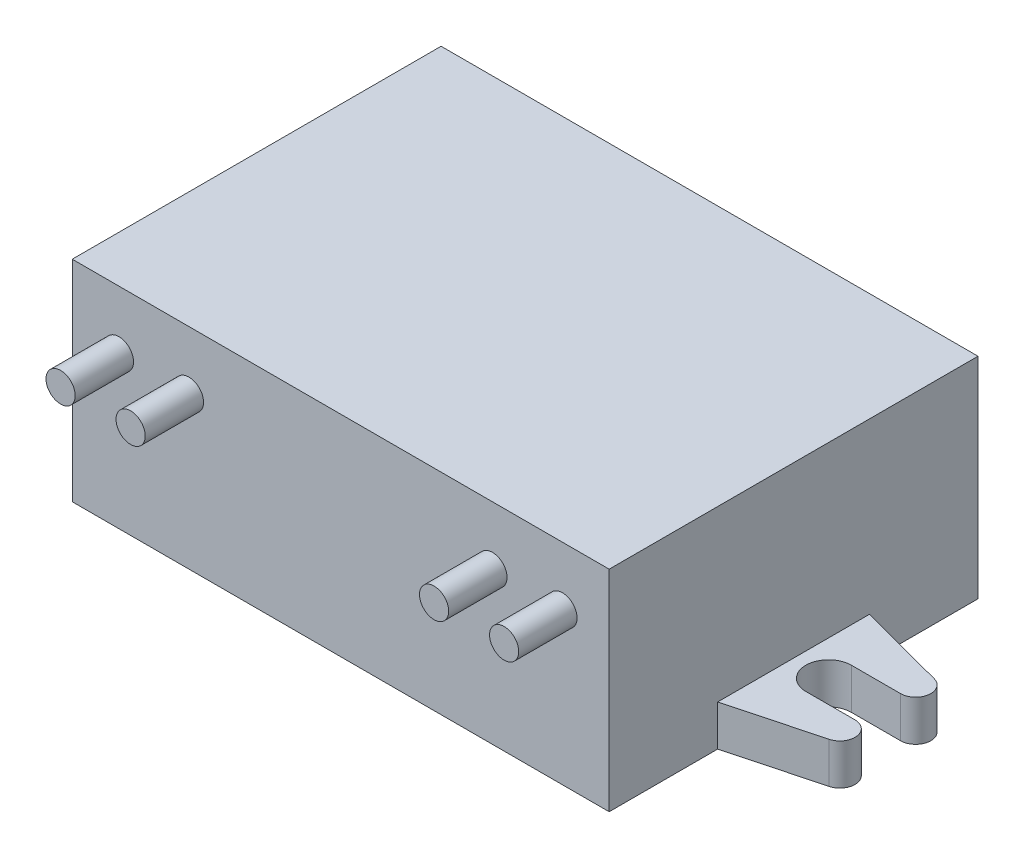
ISO-10303-21;
HEADER;
FILE_DESCRIPTION(('STEP AP214'),'2;1');
FILE_NAME('part.step','',(''),(''),'','','');
FILE_SCHEMA(('AUTOMOTIVE_DESIGN { 1 0 10303 214 1 1 1 1 }'));
ENDSEC;
DATA;
#1=APPLICATION_CONTEXT('core data for automotive mechanical design processes');
#2=APPLICATION_PROTOCOL_DEFINITION('international standard','automotive_design',2000,#1);
#3=PRODUCT_CONTEXT('',#1,'mechanical');
#4=PRODUCT('Part','Part','',(#3));
#5=PRODUCT_RELATED_PRODUCT_CATEGORY('part','',(#4));
#6=PRODUCT_DEFINITION_FORMATION('','',#4);
#7=PRODUCT_DEFINITION_CONTEXT('part definition',#1,'design');
#8=PRODUCT_DEFINITION('design','',#6,#7);
#9=PRODUCT_DEFINITION_SHAPE('','',#8);
#10=(LENGTH_UNIT() NAMED_UNIT(*) SI_UNIT(.MILLI.,.METRE.));
#11=(NAMED_UNIT(*) PLANE_ANGLE_UNIT() SI_UNIT($,.RADIAN.));
#12=(NAMED_UNIT(*) SI_UNIT($,.STERADIAN.) SOLID_ANGLE_UNIT());
#13=UNCERTAINTY_MEASURE_WITH_UNIT(LENGTH_MEASURE(1.E-05),#10,'distance_accuracy_value','');
#14=(GEOMETRIC_REPRESENTATION_CONTEXT(3) GLOBAL_UNCERTAINTY_ASSIGNED_CONTEXT((#13)) GLOBAL_UNIT_ASSIGNED_CONTEXT((#10,
#11,#12)) REPRESENTATION_CONTEXT('',''));
#15=CARTESIAN_POINT('',(0.,0.,0.));
#16=DIRECTION('',(0.,0.,1.));
#17=DIRECTION('',(1.,0.,0.));
#18=AXIS2_PLACEMENT_3D('',#15,#16,#17);
#19=CARTESIAN_POINT('',(-23.,18.,0.));
#20=DIRECTION('',(1.,0.,0.));
#21=DIRECTION('',(0.,0.,-1.));
#22=AXIS2_PLACEMENT_3D('',#19,#20,#21);
#23=PLANE('',#22);
#24=DIRECTION('',(0.,-1.,0.));
#25=VECTOR('',#24,1.);
#26=CARTESIAN_POINT('',(-23.,3.5,-6.49999999999999));
#27=LINE('',#26,#25);
#28=CARTESIAN_POINT('',(-23.,3.5,-6.49999999999999));
#29=VERTEX_POINT('',#28);
#30=CARTESIAN_POINT('',(-23.,0.,-6.49999999999999));
#31=VERTEX_POINT('',#30);
#32=EDGE_CURVE('E264',#29,#31,#27,.T.);
#33=ORIENTED_EDGE('',*,*,#32,.F.);
#34=DIRECTION('',(0.,0.,1.));
#35=VECTOR('',#34,1.);
#36=CARTESIAN_POINT('',(-23.,3.5,0.));
#37=LINE('',#36,#35);
#38=CARTESIAN_POINT('',(-23.,3.5,6.50000000000001));
#39=VERTEX_POINT('',#38);
#40=EDGE_CURVE('E261',#29,#39,#37,.T.);
#41=ORIENTED_EDGE('',*,*,#40,.T.);
#42=DIRECTION('',(0.,-1.,0.));
#43=VECTOR('',#42,1.);
#44=CARTESIAN_POINT('',(-23.,3.5,6.50000000000001));
#45=LINE('',#44,#43);
#46=CARTESIAN_POINT('',(-23.,0.,6.50000000000001));
#47=VERTEX_POINT('',#46);
#48=EDGE_CURVE('E279',#39,#47,#45,.T.);
#49=ORIENTED_EDGE('',*,*,#48,.T.);
#50=DIRECTION('',(0.,0.,1.));
#51=VECTOR('',#50,1.);
#52=CARTESIAN_POINT('',(-23.,0.,0.));
#53=LINE('',#52,#51);
#54=CARTESIAN_POINT('',(-23.,0.,15.8));
#55=VERTEX_POINT('',#54);
#56=EDGE_CURVE('E317',#47,#55,#53,.T.);
#57=ORIENTED_EDGE('',*,*,#56,.T.);
#58=DIRECTION('',(0.,-1.,0.));
#59=VECTOR('',#58,1.);
#60=CARTESIAN_POINT('',(-23.,18.,15.8));
#61=LINE('',#60,#59);
#62=CARTESIAN_POINT('',(-23.,18.,15.8));
#63=VERTEX_POINT('',#62);
#64=EDGE_CURVE('E325',#63,#55,#61,.T.);
#65=ORIENTED_EDGE('',*,*,#64,.F.);
#66=DIRECTION('',(0.,0.,1.));
#67=VECTOR('',#66,1.);
#68=CARTESIAN_POINT('',(-23.,18.,0.));
#69=LINE('',#68,#67);
#70=CARTESIAN_POINT('',(-23.,18.,-15.8));
#71=VERTEX_POINT('',#70);
#72=EDGE_CURVE('E306',#71,#63,#69,.T.);
#73=ORIENTED_EDGE('',*,*,#72,.F.);
#74=DIRECTION('',(0.,-1.,0.));
#75=VECTOR('',#74,1.);
#76=CARTESIAN_POINT('',(-23.,18.,-15.8));
#77=LINE('',#76,#75);
#78=CARTESIAN_POINT('',(-23.,0.,-15.8));
#79=VERTEX_POINT('',#78);
#80=EDGE_CURVE('E328',#71,#79,#77,.T.);
#81=ORIENTED_EDGE('',*,*,#80,.T.);
#82=EDGE_CURVE('E318',#79,#31,#53,.T.);
#83=ORIENTED_EDGE('',*,*,#82,.T.);
#84=EDGE_LOOP('',(#33,#41,#49,#57,#65,#73,#81,#83));
#85=FACE_BOUND('',#84,.T.);
#86=ADVANCED_FACE('F36',(#85),#23,.F.);
#87=CARTESIAN_POINT('',(23.,18.,0.));
#88=DIRECTION('',(1.,0.,0.));
#89=DIRECTION('',(0.,0.,-1.));
#90=AXIS2_PLACEMENT_3D('',#87,#88,#89);
#91=PLANE('',#90);
#92=DIRECTION('',(0.,-1.,0.));
#93=VECTOR('',#92,1.);
#94=CARTESIAN_POINT('',(23.,3.5,6.50000000000001));
#95=LINE('',#94,#93);
#96=CARTESIAN_POINT('',(23.,3.5,6.50000000000001));
#97=VERTEX_POINT('',#96);
#98=CARTESIAN_POINT('',(23.,0.,6.50000000000001));
#99=VERTEX_POINT('',#98);
#100=EDGE_CURVE('E235',#97,#99,#95,.T.);
#101=ORIENTED_EDGE('',*,*,#100,.F.);
#102=DIRECTION('',(0.,0.,1.));
#103=VECTOR('',#102,1.);
#104=CARTESIAN_POINT('',(23.,3.5,0.));
#105=LINE('',#104,#103);
#106=CARTESIAN_POINT('',(23.,3.5,-6.49999999999999));
#107=VERTEX_POINT('',#106);
#108=EDGE_CURVE('E214',#107,#97,#105,.T.);
#109=ORIENTED_EDGE('',*,*,#108,.F.);
#110=DIRECTION('',(0.,-1.,0.));
#111=VECTOR('',#110,1.);
#112=CARTESIAN_POINT('',(23.,3.5,-6.49999999999999));
#113=LINE('',#112,#111);
#114=CARTESIAN_POINT('',(23.,0.,-6.49999999999999));
#115=VERTEX_POINT('',#114);
#116=EDGE_CURVE('E237',#107,#115,#113,.T.);
#117=ORIENTED_EDGE('',*,*,#116,.T.);
#118=DIRECTION('',(0.,0.,1.));
#119=VECTOR('',#118,1.);
#120=CARTESIAN_POINT('',(23.,0.,0.));
#121=LINE('',#120,#119);
#122=CARTESIAN_POINT('',(23.,0.,-15.8));
#123=VERTEX_POINT('',#122);
#124=EDGE_CURVE('E311',#123,#115,#121,.T.);
#125=ORIENTED_EDGE('',*,*,#124,.F.);
#126=DIRECTION('',(0.,-1.,0.));
#127=VECTOR('',#126,1.);
#128=CARTESIAN_POINT('',(23.,18.,-15.8));
#129=LINE('',#128,#127);
#130=CARTESIAN_POINT('',(23.,18.,-15.8));
#131=VERTEX_POINT('',#130);
#132=EDGE_CURVE('E330',#131,#123,#129,.T.);
#133=ORIENTED_EDGE('',*,*,#132,.F.);
#134=DIRECTION('',(0.,0.,1.));
#135=VECTOR('',#134,1.);
#136=CARTESIAN_POINT('',(23.,18.,0.));
#137=LINE('',#136,#135);
#138=CARTESIAN_POINT('',(23.,18.,15.8));
#139=VERTEX_POINT('',#138);
#140=EDGE_CURVE('E299',#131,#139,#137,.T.);
#141=ORIENTED_EDGE('',*,*,#140,.T.);
#142=DIRECTION('',(0.,-1.,0.));
#143=VECTOR('',#142,1.);
#144=CARTESIAN_POINT('',(23.,18.,15.8));
#145=LINE('',#144,#143);
#146=CARTESIAN_POINT('',(23.,0.,15.8));
#147=VERTEX_POINT('',#146);
#148=EDGE_CURVE('E310',#139,#147,#145,.T.);
#149=ORIENTED_EDGE('',*,*,#148,.T.);
#150=EDGE_CURVE('E298',#99,#147,#121,.T.);
#151=ORIENTED_EDGE('',*,*,#150,.F.);
#152=EDGE_LOOP('',(#101,#109,#117,#125,#133,#141,#149,#151));
#153=FACE_BOUND('',#152,.T.);
#154=ADVANCED_FACE('F38',(#153),#91,.T.);
#155=CARTESIAN_POINT('',(0.,18.,-15.8));
#156=DIRECTION('',(0.,0.,-1.));
#157=DIRECTION('',(-1.,0.,0.));
#158=AXIS2_PLACEMENT_3D('',#155,#156,#157);
#159=PLANE('',#158);
#160=DIRECTION('',(1.,0.,0.));
#161=VECTOR('',#160,1.);
#162=CARTESIAN_POINT('',(0.,0.,-15.8));
#163=LINE('',#162,#161);
#164=EDGE_CURVE('E314',#79,#123,#163,.T.);
#165=ORIENTED_EDGE('',*,*,#164,.F.);
#166=ORIENTED_EDGE('',*,*,#80,.F.);
#167=DIRECTION('',(1.,0.,0.));
#168=VECTOR('',#167,1.);
#169=CARTESIAN_POINT('',(0.,18.,-15.8));
#170=LINE('',#169,#168);
#171=EDGE_CURVE('E302',#71,#131,#170,.T.);
#172=ORIENTED_EDGE('',*,*,#171,.T.);
#173=ORIENTED_EDGE('',*,*,#132,.T.);
#174=EDGE_LOOP('',(#165,#166,#172,#173));
#175=FACE_BOUND('',#174,.T.);
#176=ADVANCED_FACE('F346',(#175),#159,.T.);
#177=CARTESIAN_POINT('',(0.,18.,15.8));
#178=DIRECTION('',(0.,0.,-1.));
#179=DIRECTION('',(-1.,0.,0.));
#180=AXIS2_PLACEMENT_3D('',#177,#178,#179);
#181=PLANE('',#180);
#182=CARTESIAN_POINT('',(-13.,13.,15.8));
#183=DIRECTION('',(0.,0.,-1.));
#184=DIRECTION('',(-1.,0.,0.));
#185=AXIS2_PLACEMENT_3D('',#182,#183,#184);
#186=CIRCLE('',#185,1.25);
#187=CARTESIAN_POINT('',(-14.25,13.,15.8));
#188=VERTEX_POINT('',#187);
#189=EDGE_CURVE('E11',#188,#188,#186,.F.);
#190=ORIENTED_EDGE('',*,*,#189,.F.);
#191=EDGE_LOOP('',(#190));
#192=FACE_BOUND('',#191,.T.);
#193=CARTESIAN_POINT('',(-19.,13.,15.8));
#194=DIRECTION('',(0.,0.,-1.));
#195=DIRECTION('',(-1.,0.,0.));
#196=AXIS2_PLACEMENT_3D('',#193,#194,#195);
#197=CIRCLE('',#196,1.25);
#198=CARTESIAN_POINT('',(-20.25,13.,15.8));
#199=VERTEX_POINT('',#198);
#200=EDGE_CURVE('E44',#199,#199,#197,.F.);
#201=ORIENTED_EDGE('',*,*,#200,.F.);
#202=EDGE_LOOP('',(#201));
#203=FACE_BOUND('',#202,.T.);
#204=CARTESIAN_POINT('',(13.,13.,15.8));
#205=DIRECTION('',(0.,0.,-1.));
#206=DIRECTION('',(-1.,0.,0.));
#207=AXIS2_PLACEMENT_3D('',#204,#205,#206);
#208=CIRCLE('',#207,1.25);
#209=CARTESIAN_POINT('',(11.75,13.,15.8));
#210=VERTEX_POINT('',#209);
#211=EDGE_CURVE('E335',#210,#210,#208,.F.);
#212=ORIENTED_EDGE('',*,*,#211,.F.);
#213=EDGE_LOOP('',(#212));
#214=FACE_BOUND('',#213,.T.);
#215=CARTESIAN_POINT('',(19.,13.,15.8));
#216=DIRECTION('',(0.,0.,-1.));
#217=DIRECTION('',(-1.,0.,0.));
#218=AXIS2_PLACEMENT_3D('',#215,#216,#217);
#219=CIRCLE('',#218,1.25);
#220=CARTESIAN_POINT('',(17.75,13.,15.8));
#221=VERTEX_POINT('',#220);
#222=EDGE_CURVE('E332',#221,#221,#219,.F.);
#223=ORIENTED_EDGE('',*,*,#222,.F.);
#224=EDGE_LOOP('',(#223));
#225=FACE_BOUND('',#224,.T.);
#226=DIRECTION('',(1.,0.,0.));
#227=VECTOR('',#226,1.);
#228=CARTESIAN_POINT('',(0.,0.,15.8));
#229=LINE('',#228,#227);
#230=EDGE_CURVE('E303',#55,#147,#229,.T.);
#231=ORIENTED_EDGE('',*,*,#230,.T.);
#232=ORIENTED_EDGE('',*,*,#148,.F.);
#233=DIRECTION('',(1.,0.,0.));
#234=VECTOR('',#233,1.);
#235=CARTESIAN_POINT('',(0.,18.,15.8));
#236=LINE('',#235,#234);
#237=EDGE_CURVE('E308',#63,#139,#236,.T.);
#238=ORIENTED_EDGE('',*,*,#237,.F.);
#239=ORIENTED_EDGE('',*,*,#64,.T.);
#240=EDGE_LOOP('',(#231,#232,#238,#239));
#241=FACE_BOUND('',#240,.T.);
#242=ADVANCED_FACE('F342',(#192,#203,#214,#225,#241),#181,.F.);
#243=CARTESIAN_POINT('',(0.,18.,0.));
#244=DIRECTION('',(0.,1.,0.));
#245=DIRECTION('',(0.,0.,1.));
#246=AXIS2_PLACEMENT_3D('',#243,#244,#245);
#247=PLANE('',#246);
#248=ORIENTED_EDGE('',*,*,#140,.F.);
#249=ORIENTED_EDGE('',*,*,#171,.F.);
#250=ORIENTED_EDGE('',*,*,#72,.T.);
#251=ORIENTED_EDGE('',*,*,#237,.T.);
#252=EDGE_LOOP('',(#248,#249,#250,#251));
#253=FACE_BOUND('',#252,.T.);
#254=ADVANCED_FACE('F345',(#253),#247,.T.);
#255=CARTESIAN_POINT('',(0.,0.,0.));
#256=DIRECTION('',(0.,1.,0.));
#257=DIRECTION('',(0.,0.,1.));
#258=AXIS2_PLACEMENT_3D('',#255,#256,#257);
#259=PLANE('',#258);
#260=ORIENTED_EDGE('',*,*,#124,.T.);
#261=DIRECTION('',(0.966628418373112,0.,0.256182553647777));
#262=VECTOR('',#261,1.);
#263=CARTESIAN_POINT('',(3.11909520645809,0.,-11.768974987731));
#264=LINE('',#263,#262);
#265=CARTESIAN_POINT('',(30.546403177026,0.,-4.50000000000001));
#266=VERTEX_POINT('',#265);
#267=EDGE_CURVE('E51',#115,#266,#264,.T.);
#268=ORIENTED_EDGE('',*,*,#267,.T.);
#269=CARTESIAN_POINT('',(30.2142278124788,0.,-3.24663538682589));
#270=DIRECTION('',(0.,1.,0.));
#271=DIRECTION('',(0.,0.,1.));
#272=AXIS2_PLACEMENT_3D('',#269,#270,#271);
#273=CIRCLE('',#272,1.29663538682589);
#274=CARTESIAN_POINT('',(30.2142278124788,0.,-1.95000000000001));
#275=VERTEX_POINT('',#274);
#276=EDGE_CURVE('E228',#266,#275,#273,.F.);
#277=ORIENTED_EDGE('',*,*,#276,.T.);
#278=DIRECTION('',(-1.,0.,0.));
#279=VECTOR('',#278,1.);
#280=CARTESIAN_POINT('',(0.,0.,-1.95));
#281=LINE('',#280,#279);
#282=CARTESIAN_POINT('',(26.,0.,-1.95000000000001));
#283=VERTEX_POINT('',#282);
#284=EDGE_CURVE('E225',#275,#283,#281,.T.);
#285=ORIENTED_EDGE('',*,*,#284,.T.);
#286=CARTESIAN_POINT('',(26.,0.,0.));
#287=DIRECTION('',(0.,1.,0.));
#288=DIRECTION('',(0.,0.,1.));
#289=AXIS2_PLACEMENT_3D('',#286,#287,#288);
#290=CIRCLE('',#289,1.95);
#291=CARTESIAN_POINT('',(26.,0.,1.94999999999999));
#292=VERTEX_POINT('',#291);
#293=EDGE_CURVE('E222',#283,#292,#290,.T.);
#294=ORIENTED_EDGE('',*,*,#293,.T.);
#295=DIRECTION('',(1.,0.,0.));
#296=VECTOR('',#295,1.);
#297=CARTESIAN_POINT('',(0.,0.,1.95));
#298=LINE('',#297,#296);
#299=CARTESIAN_POINT('',(30.2142278124788,0.,1.94999999999999));
#300=VERTEX_POINT('',#299);
#301=EDGE_CURVE('E219',#292,#300,#298,.T.);
#302=ORIENTED_EDGE('',*,*,#301,.T.);
#303=CARTESIAN_POINT('',(30.2142278124788,0.,3.24663538682588));
#304=DIRECTION('',(0.,1.,0.));
#305=DIRECTION('',(0.,0.,1.));
#306=AXIS2_PLACEMENT_3D('',#303,#304,#305);
#307=CIRCLE('',#306,1.29663538682589);
#308=CARTESIAN_POINT('',(30.546403177026,0.,4.49999999999999));
#309=VERTEX_POINT('',#308);
#310=EDGE_CURVE('E181',#300,#309,#307,.F.);
#311=ORIENTED_EDGE('',*,*,#310,.T.);
#312=DIRECTION('',(-0.966628418373111,0.,0.256182553647781));
#313=VECTOR('',#312,1.);
#314=CARTESIAN_POINT('',(3.11909520645817,0.,11.7689749877311));
#315=LINE('',#314,#313);
#316=EDGE_CURVE('E197',#309,#99,#315,.T.);
#317=ORIENTED_EDGE('',*,*,#316,.T.);
#318=ORIENTED_EDGE('',*,*,#150,.T.);
#319=ORIENTED_EDGE('',*,*,#230,.F.);
#320=ORIENTED_EDGE('',*,*,#56,.F.);
#321=DIRECTION('',(0.966628418373111,0.,0.256182553647781));
#322=VECTOR('',#321,1.);
#323=CARTESIAN_POINT('',(-3.11909520645817,0.,11.7689749877311));
#324=LINE('',#323,#322);
#325=CARTESIAN_POINT('',(-30.546403177026,0.,4.5));
#326=VERTEX_POINT('',#325);
#327=EDGE_CURVE('E59',#326,#47,#324,.T.);
#328=ORIENTED_EDGE('',*,*,#327,.F.);
#329=CARTESIAN_POINT('',(-30.2142278124788,0.,3.24663538682589));
#330=DIRECTION('',(0.,1.,0.));
#331=DIRECTION('',(0.,0.,1.));
#332=AXIS2_PLACEMENT_3D('',#329,#330,#331);
#333=CIRCLE('',#332,1.29663538682589);
#334=CARTESIAN_POINT('',(-30.2142278124788,0.,1.95));
#335=VERTEX_POINT('',#334);
#336=EDGE_CURVE('E275',#335,#326,#333,.T.);
#337=ORIENTED_EDGE('',*,*,#336,.F.);
#338=DIRECTION('',(-1.,0.,0.));
#339=VECTOR('',#338,1.);
#340=CARTESIAN_POINT('',(0.,0.,1.95));
#341=LINE('',#340,#339);
#342=CARTESIAN_POINT('',(-26.,0.,1.95));
#343=VERTEX_POINT('',#342);
#344=EDGE_CURVE('E273',#343,#335,#341,.T.);
#345=ORIENTED_EDGE('',*,*,#344,.F.);
#346=CARTESIAN_POINT('',(-26.,0.,0.));
#347=DIRECTION('',(0.,1.,0.));
#348=DIRECTION('',(0.,0.,1.));
#349=AXIS2_PLACEMENT_3D('',#346,#347,#348);
#350=CIRCLE('',#349,1.95);
#351=CARTESIAN_POINT('',(-26.,0.,-1.95));
#352=VERTEX_POINT('',#351);
#353=EDGE_CURVE('E271',#352,#343,#350,.F.);
#354=ORIENTED_EDGE('',*,*,#353,.F.);
#355=DIRECTION('',(1.,0.,0.));
#356=VECTOR('',#355,1.);
#357=CARTESIAN_POINT('',(0.,0.,-1.95));
#358=LINE('',#357,#356);
#359=CARTESIAN_POINT('',(-30.2142278124788,0.,-1.95));
#360=VERTEX_POINT('',#359);
#361=EDGE_CURVE('E269',#360,#352,#358,.T.);
#362=ORIENTED_EDGE('',*,*,#361,.F.);
#363=CARTESIAN_POINT('',(-30.2142278124788,0.,-3.24663538682589));
#364=DIRECTION('',(0.,1.,0.));
#365=DIRECTION('',(0.,0.,1.));
#366=AXIS2_PLACEMENT_3D('',#363,#364,#365);
#367=CIRCLE('',#366,1.29663538682589);
#368=CARTESIAN_POINT('',(-30.546403177026,0.,-4.5));
#369=VERTEX_POINT('',#368);
#370=EDGE_CURVE('E267',#369,#360,#367,.T.);
#371=ORIENTED_EDGE('',*,*,#370,.F.);
#372=DIRECTION('',(-0.966628418373112,0.,0.256182553647778));
#373=VECTOR('',#372,1.);
#374=CARTESIAN_POINT('',(-3.1190952064581,0.,-11.768974987731));
#375=LINE('',#374,#373);
#376=EDGE_CURVE('E186',#31,#369,#375,.T.);
#377=ORIENTED_EDGE('',*,*,#376,.F.);
#378=ORIENTED_EDGE('',*,*,#82,.F.);
#379=ORIENTED_EDGE('',*,*,#164,.T.);
#380=EDGE_LOOP('',(#260,#268,#277,#285,#294,#302,#311,#317,#318,#319,#320,#328,#337,#345,#354,
#362,#371,#377,#378,#379));
#381=FACE_BOUND('',#380,.T.);
#382=ADVANCED_FACE('F359',(#381),#259,.F.);
#383=CARTESIAN_POINT('',(-3.1190952064581,3.5,-11.768974987731));
#384=DIRECTION('',(0.256182553647778,0.,0.966628418373112));
#385=DIRECTION('',(0.966628418373112,0.,-0.256182553647778));
#386=AXIS2_PLACEMENT_3D('',#383,#384,#385);
#387=PLANE('',#386);
#388=ORIENTED_EDGE('',*,*,#376,.T.);
#389=DIRECTION('',(0.,-1.,0.));
#390=VECTOR('',#389,1.);
#391=CARTESIAN_POINT('',(-30.546403177026,3.5,-4.5));
#392=LINE('',#391,#390);
#393=CARTESIAN_POINT('',(-30.546403177026,3.5,-4.5));
#394=VERTEX_POINT('',#393);
#395=EDGE_CURVE('E295',#394,#369,#392,.T.);
#396=ORIENTED_EDGE('',*,*,#395,.F.);
#397=DIRECTION('',(-0.966628418373112,0.,0.256182553647778));
#398=VECTOR('',#397,1.);
#399=CARTESIAN_POINT('',(-3.1190952064581,3.5,-11.768974987731));
#400=LINE('',#399,#398);
#401=EDGE_CURVE('E246',#29,#394,#400,.T.);
#402=ORIENTED_EDGE('',*,*,#401,.F.);
#403=ORIENTED_EDGE('',*,*,#32,.T.);
#404=EDGE_LOOP('',(#388,#396,#402,#403));
#405=FACE_BOUND('',#404,.T.);
#406=ADVANCED_FACE('F405',(#405),#387,.F.);
#407=CARTESIAN_POINT('',(-30.2142278124788,3.5,-3.24663538682589));
#408=DIRECTION('',(0.,-1.,0.));
#409=DIRECTION('',(0.,0.,-1.));
#410=AXIS2_PLACEMENT_3D('',#407,#408,#409);
#411=CYLINDRICAL_SURFACE('',#410,1.29663538682589);
#412=ORIENTED_EDGE('',*,*,#370,.T.);
#413=DIRECTION('',(0.,-1.,0.));
#414=VECTOR('',#413,1.);
#415=CARTESIAN_POINT('',(-30.2142278124788,3.5,-1.95));
#416=LINE('',#415,#414);
#417=CARTESIAN_POINT('',(-30.2142278124788,3.5,-1.95));
#418=VERTEX_POINT('',#417);
#419=EDGE_CURVE('E292',#418,#360,#416,.T.);
#420=ORIENTED_EDGE('',*,*,#419,.F.);
#421=CARTESIAN_POINT('',(-30.2142278124788,3.5,-3.24663538682589));
#422=DIRECTION('',(0.,1.,0.));
#423=DIRECTION('',(0.,0.,1.));
#424=AXIS2_PLACEMENT_3D('',#421,#422,#423);
#425=CIRCLE('',#424,1.29663538682589);
#426=EDGE_CURVE('E249',#394,#418,#425,.T.);
#427=ORIENTED_EDGE('',*,*,#426,.F.);
#428=ORIENTED_EDGE('',*,*,#395,.T.);
#429=EDGE_LOOP('',(#412,#420,#427,#428));
#430=FACE_BOUND('',#429,.T.);
#431=ADVANCED_FACE('F403',(#430),#411,.T.);
#432=CARTESIAN_POINT('',(0.,3.5,-1.95));
#433=DIRECTION('',(0.,0.,-1.));
#434=DIRECTION('',(-1.,0.,0.));
#435=AXIS2_PLACEMENT_3D('',#432,#433,#434);
#436=PLANE('',#435);
#437=ORIENTED_EDGE('',*,*,#361,.T.);
#438=DIRECTION('',(0.,-1.,0.));
#439=VECTOR('',#438,1.);
#440=CARTESIAN_POINT('',(-26.,3.5,-1.95));
#441=LINE('',#440,#439);
#442=CARTESIAN_POINT('',(-26.,3.5,-1.95));
#443=VERTEX_POINT('',#442);
#444=EDGE_CURVE('E289',#443,#352,#441,.T.);
#445=ORIENTED_EDGE('',*,*,#444,.F.);
#446=DIRECTION('',(1.,0.,0.));
#447=VECTOR('',#446,1.);
#448=CARTESIAN_POINT('',(0.,3.5,-1.95));
#449=LINE('',#448,#447);
#450=EDGE_CURVE('E251',#418,#443,#449,.T.);
#451=ORIENTED_EDGE('',*,*,#450,.F.);
#452=ORIENTED_EDGE('',*,*,#419,.T.);
#453=EDGE_LOOP('',(#437,#445,#451,#452));
#454=FACE_BOUND('',#453,.T.);
#455=ADVANCED_FACE('F398',(#454),#436,.F.);
#456=CARTESIAN_POINT('',(-26.,3.5,0.));
#457=DIRECTION('',(0.,-1.,0.));
#458=DIRECTION('',(0.,0.,-1.));
#459=AXIS2_PLACEMENT_3D('',#456,#457,#458);
#460=CYLINDRICAL_SURFACE('',#459,1.95);
#461=ORIENTED_EDGE('',*,*,#353,.T.);
#462=DIRECTION('',(0.,-1.,0.));
#463=VECTOR('',#462,1.);
#464=CARTESIAN_POINT('',(-26.,3.5,1.95));
#465=LINE('',#464,#463);
#466=CARTESIAN_POINT('',(-26.,3.5,1.95));
#467=VERTEX_POINT('',#466);
#468=EDGE_CURVE('E286',#467,#343,#465,.T.);
#469=ORIENTED_EDGE('',*,*,#468,.F.);
#470=CARTESIAN_POINT('',(-26.,3.5,0.));
#471=DIRECTION('',(0.,1.,0.));
#472=DIRECTION('',(0.,0.,1.));
#473=AXIS2_PLACEMENT_3D('',#470,#471,#472);
#474=CIRCLE('',#473,1.95);
#475=EDGE_CURVE('E253',#443,#467,#474,.F.);
#476=ORIENTED_EDGE('',*,*,#475,.F.);
#477=ORIENTED_EDGE('',*,*,#444,.T.);
#478=EDGE_LOOP('',(#461,#469,#476,#477));
#479=FACE_BOUND('',#478,.T.);
#480=ADVANCED_FACE('F394',(#479),#460,.F.);
#481=CARTESIAN_POINT('',(0.,3.5,1.95));
#482=DIRECTION('',(0.,0.,1.));
#483=DIRECTION('',(1.,0.,0.));
#484=AXIS2_PLACEMENT_3D('',#481,#482,#483);
#485=PLANE('',#484);
#486=ORIENTED_EDGE('',*,*,#344,.T.);
#487=DIRECTION('',(0.,-1.,0.));
#488=VECTOR('',#487,1.);
#489=CARTESIAN_POINT('',(-30.2142278124788,3.5,1.95));
#490=LINE('',#489,#488);
#491=CARTESIAN_POINT('',(-30.2142278124788,3.5,1.95));
#492=VERTEX_POINT('',#491);
#493=EDGE_CURVE('E283',#492,#335,#490,.T.);
#494=ORIENTED_EDGE('',*,*,#493,.F.);
#495=DIRECTION('',(-1.,0.,0.));
#496=VECTOR('',#495,1.);
#497=CARTESIAN_POINT('',(0.,3.5,1.95));
#498=LINE('',#497,#496);
#499=EDGE_CURVE('E255',#467,#492,#498,.T.);
#500=ORIENTED_EDGE('',*,*,#499,.F.);
#501=ORIENTED_EDGE('',*,*,#468,.T.);
#502=EDGE_LOOP('',(#486,#494,#500,#501));
#503=FACE_BOUND('',#502,.T.);
#504=ADVANCED_FACE('F390',(#503),#485,.F.);
#505=CARTESIAN_POINT('',(-30.2142278124788,3.5,3.24663538682589));
#506=DIRECTION('',(0.,-1.,0.));
#507=DIRECTION('',(0.,0.,-1.));
#508=AXIS2_PLACEMENT_3D('',#505,#506,#507);
#509=CYLINDRICAL_SURFACE('',#508,1.29663538682589);
#510=ORIENTED_EDGE('',*,*,#336,.T.);
#511=DIRECTION('',(0.,-1.,0.));
#512=VECTOR('',#511,1.);
#513=CARTESIAN_POINT('',(-30.546403177026,3.5,4.5));
#514=LINE('',#513,#512);
#515=CARTESIAN_POINT('',(-30.546403177026,3.5,4.5));
#516=VERTEX_POINT('',#515);
#517=EDGE_CURVE('E281',#516,#326,#514,.T.);
#518=ORIENTED_EDGE('',*,*,#517,.F.);
#519=CARTESIAN_POINT('',(-30.2142278124788,3.5,3.24663538682589));
#520=DIRECTION('',(0.,1.,0.));
#521=DIRECTION('',(0.,0.,1.));
#522=AXIS2_PLACEMENT_3D('',#519,#520,#521);
#523=CIRCLE('',#522,1.29663538682589);
#524=EDGE_CURVE('E257',#492,#516,#523,.T.);
#525=ORIENTED_EDGE('',*,*,#524,.F.);
#526=ORIENTED_EDGE('',*,*,#493,.T.);
#527=EDGE_LOOP('',(#510,#518,#525,#526));
#528=FACE_BOUND('',#527,.T.);
#529=ADVANCED_FACE('F384',(#528),#509,.T.);
#530=CARTESIAN_POINT('',(-3.11909520645817,3.5,11.7689749877311));
#531=DIRECTION('',(0.256182553647781,0.,-0.966628418373111));
#532=DIRECTION('',(-0.966628418373111,0.,-0.256182553647781));
#533=AXIS2_PLACEMENT_3D('',#530,#531,#532);
#534=PLANE('',#533);
#535=ORIENTED_EDGE('',*,*,#327,.T.);
#536=ORIENTED_EDGE('',*,*,#48,.F.);
#537=DIRECTION('',(0.966628418373111,0.,0.256182553647781));
#538=VECTOR('',#537,1.);
#539=CARTESIAN_POINT('',(-3.11909520645817,3.5,11.7689749877311));
#540=LINE('',#539,#538);
#541=EDGE_CURVE('E259',#516,#39,#540,.T.);
#542=ORIENTED_EDGE('',*,*,#541,.F.);
#543=ORIENTED_EDGE('',*,*,#517,.T.);
#544=EDGE_LOOP('',(#535,#536,#542,#543));
#545=FACE_BOUND('',#544,.T.);
#546=ADVANCED_FACE('F376',(#545),#534,.F.);
#547=CARTESIAN_POINT('',(0.,3.5,0.));
#548=DIRECTION('',(0.,1.,0.));
#549=DIRECTION('',(0.,0.,1.));
#550=AXIS2_PLACEMENT_3D('',#547,#548,#549);
#551=PLANE('',#550);
#552=ORIENTED_EDGE('',*,*,#401,.T.);
#553=ORIENTED_EDGE('',*,*,#426,.T.);
#554=ORIENTED_EDGE('',*,*,#450,.T.);
#555=ORIENTED_EDGE('',*,*,#475,.T.);
#556=ORIENTED_EDGE('',*,*,#499,.T.);
#557=ORIENTED_EDGE('',*,*,#524,.T.);
#558=ORIENTED_EDGE('',*,*,#541,.T.);
#559=ORIENTED_EDGE('',*,*,#40,.F.);
#560=EDGE_LOOP('',(#552,#553,#554,#555,#556,#557,#558,#559));
#561=FACE_BOUND('',#560,.T.);
#562=ADVANCED_FACE('F379',(#561),#551,.T.);
#563=CARTESIAN_POINT('',(30.2142278124788,3.5,3.24663538682588));
#564=DIRECTION('',(0.,-1.,0.));
#565=DIRECTION('',(0.,0.,-1.));
#566=AXIS2_PLACEMENT_3D('',#563,#564,#565);
#567=CYLINDRICAL_SURFACE('',#566,1.29663538682589);
#568=ORIENTED_EDGE('',*,*,#310,.F.);
#569=DIRECTION('',(0.,-1.,0.));
#570=VECTOR('',#569,1.);
#571=CARTESIAN_POINT('',(30.2142278124788,3.5,1.94999999999999));
#572=LINE('',#571,#570);
#573=CARTESIAN_POINT('',(30.2142278124788,3.5,1.94999999999999));
#574=VERTEX_POINT('',#573);
#575=EDGE_CURVE('E175',#574,#300,#572,.T.);
#576=ORIENTED_EDGE('',*,*,#575,.F.);
#577=CARTESIAN_POINT('',(30.2142278124788,3.5,3.24663538682588));
#578=DIRECTION('',(0.,1.,0.));
#579=DIRECTION('',(0.,0.,1.));
#580=AXIS2_PLACEMENT_3D('',#577,#578,#579);
#581=CIRCLE('',#580,1.29663538682589);
#582=CARTESIAN_POINT('',(30.546403177026,3.5,4.49999999999999));
#583=VERTEX_POINT('',#582);
#584=EDGE_CURVE('E178',#574,#583,#581,.F.);
#585=ORIENTED_EDGE('',*,*,#584,.T.);
#586=DIRECTION('',(0.,-1.,0.));
#587=VECTOR('',#586,1.);
#588=CARTESIAN_POINT('',(30.546403177026,3.5,4.49999999999999));
#589=LINE('',#588,#587);
#590=EDGE_CURVE('E217',#583,#309,#589,.T.);
#591=ORIENTED_EDGE('',*,*,#590,.T.);
#592=EDGE_LOOP('',(#568,#576,#585,#591));
#593=FACE_BOUND('',#592,.T.);
#594=ADVANCED_FACE('F177',(#593),#567,.T.);
#595=CARTESIAN_POINT('',(0.,3.5,1.95));
#596=DIRECTION('',(0.,0.,-1.));
#597=DIRECTION('',(-1.,0.,0.));
#598=AXIS2_PLACEMENT_3D('',#595,#596,#597);
#599=PLANE('',#598);
#600=ORIENTED_EDGE('',*,*,#301,.F.);
#601=DIRECTION('',(0.,-1.,0.));
#602=VECTOR('',#601,1.);
#603=CARTESIAN_POINT('',(26.,3.5,1.94999999999999));
#604=LINE('',#603,#602);
#605=CARTESIAN_POINT('',(26.,3.5,1.94999999999999));
#606=VERTEX_POINT('',#605);
#607=EDGE_CURVE('E187',#606,#292,#604,.T.);
#608=ORIENTED_EDGE('',*,*,#607,.F.);
#609=DIRECTION('',(1.,0.,0.));
#610=VECTOR('',#609,1.);
#611=CARTESIAN_POINT('',(0.,3.5,1.95));
#612=LINE('',#611,#610);
#613=EDGE_CURVE('E193',#606,#574,#612,.T.);
#614=ORIENTED_EDGE('',*,*,#613,.T.);
#615=ORIENTED_EDGE('',*,*,#575,.T.);
#616=EDGE_LOOP('',(#600,#608,#614,#615));
#617=FACE_BOUND('',#616,.T.);
#618=ADVANCED_FACE('F199',(#617),#599,.T.);
#619=CARTESIAN_POINT('',(26.,3.5,0.));
#620=DIRECTION('',(0.,-1.,0.));
#621=DIRECTION('',(0.,0.,-1.));
#622=AXIS2_PLACEMENT_3D('',#619,#620,#621);
#623=CYLINDRICAL_SURFACE('',#622,1.95);
#624=ORIENTED_EDGE('',*,*,#293,.F.);
#625=DIRECTION('',(0.,-1.,0.));
#626=VECTOR('',#625,1.);
#627=CARTESIAN_POINT('',(26.,3.5,-1.95000000000001));
#628=LINE('',#627,#626);
#629=CARTESIAN_POINT('',(26.,3.5,-1.95000000000001));
#630=VERTEX_POINT('',#629);
#631=EDGE_CURVE('E243',#630,#283,#628,.T.);
#632=ORIENTED_EDGE('',*,*,#631,.F.);
#633=CARTESIAN_POINT('',(26.,3.5,0.));
#634=DIRECTION('',(0.,1.,0.));
#635=DIRECTION('',(0.,0.,1.));
#636=AXIS2_PLACEMENT_3D('',#633,#634,#635);
#637=CIRCLE('',#636,1.95);
#638=EDGE_CURVE('E200',#630,#606,#637,.T.);
#639=ORIENTED_EDGE('',*,*,#638,.T.);
#640=ORIENTED_EDGE('',*,*,#607,.T.);
#641=EDGE_LOOP('',(#624,#632,#639,#640));
#642=FACE_BOUND('',#641,.T.);
#643=ADVANCED_FACE('F419',(#642),#623,.F.);
#644=CARTESIAN_POINT('',(0.,3.5,-1.95));
#645=DIRECTION('',(0.,0.,1.));
#646=DIRECTION('',(1.,0.,0.));
#647=AXIS2_PLACEMENT_3D('',#644,#645,#646);
#648=PLANE('',#647);
#649=ORIENTED_EDGE('',*,*,#284,.F.);
#650=DIRECTION('',(0.,-1.,0.));
#651=VECTOR('',#650,1.);
#652=CARTESIAN_POINT('',(30.2142278124788,3.5,-1.95000000000001));
#653=LINE('',#652,#651);
#654=CARTESIAN_POINT('',(30.2142278124788,3.5,-1.95000000000001));
#655=VERTEX_POINT('',#654);
#656=EDGE_CURVE('E241',#655,#275,#653,.T.);
#657=ORIENTED_EDGE('',*,*,#656,.F.);
#658=DIRECTION('',(-1.,0.,0.));
#659=VECTOR('',#658,1.);
#660=CARTESIAN_POINT('',(0.,3.5,-1.95));
#661=LINE('',#660,#659);
#662=EDGE_CURVE('E202',#655,#630,#661,.T.);
#663=ORIENTED_EDGE('',*,*,#662,.T.);
#664=ORIENTED_EDGE('',*,*,#631,.T.);
#665=EDGE_LOOP('',(#649,#657,#663,#664));
#666=FACE_BOUND('',#665,.T.);
#667=ADVANCED_FACE('F417',(#666),#648,.T.);
#668=CARTESIAN_POINT('',(30.2142278124788,3.5,-3.24663538682589));
#669=DIRECTION('',(0.,-1.,0.));
#670=DIRECTION('',(0.,0.,-1.));
#671=AXIS2_PLACEMENT_3D('',#668,#669,#670);
#672=CYLINDRICAL_SURFACE('',#671,1.29663538682589);
#673=ORIENTED_EDGE('',*,*,#276,.F.);
#674=DIRECTION('',(0.,-1.,0.));
#675=VECTOR('',#674,1.);
#676=CARTESIAN_POINT('',(30.546403177026,3.5,-4.50000000000001));
#677=LINE('',#676,#675);
#678=CARTESIAN_POINT('',(30.546403177026,3.5,-4.50000000000001));
#679=VERTEX_POINT('',#678);
#680=EDGE_CURVE('E239',#679,#266,#677,.T.);
#681=ORIENTED_EDGE('',*,*,#680,.F.);
#682=CARTESIAN_POINT('',(30.2142278124788,3.5,-3.24663538682589));
#683=DIRECTION('',(0.,1.,0.));
#684=DIRECTION('',(0.,0.,1.));
#685=AXIS2_PLACEMENT_3D('',#682,#683,#684);
#686=CIRCLE('',#685,1.29663538682589);
#687=EDGE_CURVE('E208',#679,#655,#686,.F.);
#688=ORIENTED_EDGE('',*,*,#687,.T.);
#689=ORIENTED_EDGE('',*,*,#656,.T.);
#690=EDGE_LOOP('',(#673,#681,#688,#689));
#691=FACE_BOUND('',#690,.T.);
#692=ADVANCED_FACE('F413',(#691),#672,.T.);
#693=CARTESIAN_POINT('',(3.11909520645809,3.5,-11.768974987731));
#694=DIRECTION('',(0.256182553647777,0.,-0.966628418373112));
#695=DIRECTION('',(-0.966628418373112,0.,-0.256182553647777));
#696=AXIS2_PLACEMENT_3D('',#693,#694,#695);
#697=PLANE('',#696);
#698=ORIENTED_EDGE('',*,*,#267,.F.);
#699=ORIENTED_EDGE('',*,*,#116,.F.);
#700=DIRECTION('',(0.966628418373112,0.,0.256182553647777));
#701=VECTOR('',#700,1.);
#702=CARTESIAN_POINT('',(3.11909520645809,3.5,-11.768974987731));
#703=LINE('',#702,#701);
#704=EDGE_CURVE('E211',#107,#679,#703,.T.);
#705=ORIENTED_EDGE('',*,*,#704,.T.);
#706=ORIENTED_EDGE('',*,*,#680,.T.);
#707=EDGE_LOOP('',(#698,#699,#705,#706));
#708=FACE_BOUND('',#707,.T.);
#709=ADVANCED_FACE('F408',(#708),#697,.T.);
#710=CARTESIAN_POINT('',(3.11909520645817,3.5,11.7689749877311));
#711=DIRECTION('',(0.256182553647781,0.,0.966628418373111));
#712=DIRECTION('',(0.966628418373111,0.,-0.256182553647781));
#713=AXIS2_PLACEMENT_3D('',#710,#711,#712);
#714=PLANE('',#713);
#715=ORIENTED_EDGE('',*,*,#316,.F.);
#716=ORIENTED_EDGE('',*,*,#590,.F.);
#717=DIRECTION('',(-0.966628418373111,0.,0.256182553647781));
#718=VECTOR('',#717,1.);
#719=CARTESIAN_POINT('',(3.11909520645817,3.5,11.7689749877311));
#720=LINE('',#719,#718);
#721=EDGE_CURVE('E196',#583,#97,#720,.T.);
#722=ORIENTED_EDGE('',*,*,#721,.T.);
#723=ORIENTED_EDGE('',*,*,#100,.T.);
#724=EDGE_LOOP('',(#715,#716,#722,#723));
#725=FACE_BOUND('',#724,.T.);
#726=ADVANCED_FACE('F421',(#725),#714,.T.);
#727=CARTESIAN_POINT('',(0.,3.5,0.));
#728=DIRECTION('',(0.,1.,0.));
#729=DIRECTION('',(0.,0.,1.));
#730=AXIS2_PLACEMENT_3D('',#727,#728,#729);
#731=PLANE('',#730);
#732=ORIENTED_EDGE('',*,*,#584,.F.);
#733=ORIENTED_EDGE('',*,*,#613,.F.);
#734=ORIENTED_EDGE('',*,*,#638,.F.);
#735=ORIENTED_EDGE('',*,*,#662,.F.);
#736=ORIENTED_EDGE('',*,*,#687,.F.);
#737=ORIENTED_EDGE('',*,*,#704,.F.);
#738=ORIENTED_EDGE('',*,*,#108,.T.);
#739=ORIENTED_EDGE('',*,*,#721,.F.);
#740=EDGE_LOOP('',(#732,#733,#734,#735,#736,#737,#738,#739));
#741=FACE_BOUND('',#740,.T.);
#742=ADVANCED_FACE('F191',(#741),#731,.T.);
#743=CARTESIAN_POINT('',(19.,13.,20.8));
#744=DIRECTION('',(0.,0.,-1.));
#745=DIRECTION('',(-1.,0.,0.));
#746=AXIS2_PLACEMENT_3D('',#743,#744,#745);
#747=CYLINDRICAL_SURFACE('',#746,1.25);
#748=CARTESIAN_POINT('',(19.,13.,20.8));
#749=DIRECTION('',(0.,0.,1.));
#750=DIRECTION('',(1.,0.,0.));
#751=AXIS2_PLACEMENT_3D('',#748,#749,#750);
#752=CIRCLE('',#751,1.25);
#753=CARTESIAN_POINT('',(20.25,13.,20.8));
#754=VERTEX_POINT('',#753);
#755=EDGE_CURVE('E220',#754,#754,#752,.T.);
#756=ORIENTED_EDGE('',*,*,#755,.F.);
#757=EDGE_LOOP('',(#756));
#758=FACE_BOUND('',#757,.T.);
#759=ORIENTED_EDGE('',*,*,#222,.T.);
#760=EDGE_LOOP('',(#759));
#761=FACE_BOUND('',#760,.T.);
#762=ADVANCED_FACE('F428',(#758,#761),#747,.T.);
#763=CARTESIAN_POINT('',(19.,13.,20.8));
#764=DIRECTION('',(0.,0.,1.));
#765=DIRECTION('',(1.,0.,0.));
#766=AXIS2_PLACEMENT_3D('',#763,#764,#765);
#767=PLANE('',#766);
#768=ORIENTED_EDGE('',*,*,#755,.T.);
#769=EDGE_LOOP('',(#768));
#770=FACE_BOUND('',#769,.T.);
#771=ADVANCED_FACE('F558',(#770),#767,.T.);
#772=CARTESIAN_POINT('',(13.,13.,20.8));
#773=DIRECTION('',(0.,0.,-1.));
#774=DIRECTION('',(-1.,0.,0.));
#775=AXIS2_PLACEMENT_3D('',#772,#773,#774);
#776=CYLINDRICAL_SURFACE('',#775,1.25);
#777=CARTESIAN_POINT('',(13.,13.,20.8));
#778=DIRECTION('',(0.,0.,1.));
#779=DIRECTION('',(1.,0.,0.));
#780=AXIS2_PLACEMENT_3D('',#777,#778,#779);
#781=CIRCLE('',#780,1.25);
#782=CARTESIAN_POINT('',(14.25,13.,20.8));
#783=VERTEX_POINT('',#782);
#784=EDGE_CURVE('E637',#783,#783,#781,.T.);
#785=ORIENTED_EDGE('',*,*,#784,.F.);
#786=EDGE_LOOP('',(#785));
#787=FACE_BOUND('',#786,.T.);
#788=ORIENTED_EDGE('',*,*,#211,.T.);
#789=EDGE_LOOP('',(#788));
#790=FACE_BOUND('',#789,.T.);
#791=ADVANCED_FACE('F565',(#787,#790),#776,.T.);
#792=CARTESIAN_POINT('',(13.,13.,20.8));
#793=DIRECTION('',(0.,0.,1.));
#794=DIRECTION('',(1.,0.,0.));
#795=AXIS2_PLACEMENT_3D('',#792,#793,#794);
#796=PLANE('',#795);
#797=ORIENTED_EDGE('',*,*,#784,.T.);
#798=EDGE_LOOP('',(#797));
#799=FACE_BOUND('',#798,.T.);
#800=ADVANCED_FACE('F573',(#799),#796,.T.);
#801=CARTESIAN_POINT('',(-19.,13.,20.8));
#802=DIRECTION('',(0.,0.,-1.));
#803=DIRECTION('',(-1.,0.,0.));
#804=AXIS2_PLACEMENT_3D('',#801,#802,#803);
#805=CYLINDRICAL_SURFACE('',#804,1.25);
#806=CARTESIAN_POINT('',(-19.,13.,20.8));
#807=DIRECTION('',(0.,0.,1.));
#808=DIRECTION('',(-1.,0.,0.));
#809=AXIS2_PLACEMENT_3D('',#806,#807,#808);
#810=CIRCLE('',#809,1.25);
#811=CARTESIAN_POINT('',(-20.25,13.,20.8));
#812=VERTEX_POINT('',#811);
#813=EDGE_CURVE('E634',#812,#812,#810,.T.);
#814=ORIENTED_EDGE('',*,*,#813,.F.);
#815=EDGE_LOOP('',(#814));
#816=FACE_BOUND('',#815,.T.);
#817=ORIENTED_EDGE('',*,*,#200,.T.);
#818=EDGE_LOOP('',(#817));
#819=FACE_BOUND('',#818,.T.);
#820=ADVANCED_FACE('F340',(#816,#819),#805,.T.);
#821=CARTESIAN_POINT('',(-19.,13.,20.8));
#822=DIRECTION('',(0.,0.,-1.));
#823=DIRECTION('',(-1.,0.,0.));
#824=AXIS2_PLACEMENT_3D('',#821,#822,#823);
#825=PLANE('',#824);
#826=ORIENTED_EDGE('',*,*,#813,.T.);
#827=EDGE_LOOP('',(#826));
#828=FACE_BOUND('',#827,.T.);
#829=ADVANCED_FACE('F588',(#828),#825,.F.);
#830=CARTESIAN_POINT('',(-13.,13.,20.8));
#831=DIRECTION('',(0.,0.,-1.));
#832=DIRECTION('',(-1.,0.,0.));
#833=AXIS2_PLACEMENT_3D('',#830,#831,#832);
#834=CYLINDRICAL_SURFACE('',#833,1.25);
#835=CARTESIAN_POINT('',(-13.,13.,20.8));
#836=DIRECTION('',(0.,0.,1.));
#837=DIRECTION('',(-1.,0.,0.));
#838=AXIS2_PLACEMENT_3D('',#835,#836,#837);
#839=CIRCLE('',#838,1.25);
#840=CARTESIAN_POINT('',(-14.25,13.,20.8));
#841=VERTEX_POINT('',#840);
#842=EDGE_CURVE('E633',#841,#841,#839,.T.);
#843=ORIENTED_EDGE('',*,*,#842,.F.);
#844=EDGE_LOOP('',(#843));
#845=FACE_BOUND('',#844,.T.);
#846=ORIENTED_EDGE('',*,*,#189,.T.);
#847=EDGE_LOOP('',(#846));
#848=FACE_BOUND('',#847,.T.);
#849=ADVANCED_FACE('F596',(#845,#848),#834,.T.);
#850=CARTESIAN_POINT('',(-13.,13.,20.8));
#851=DIRECTION('',(0.,0.,-1.));
#852=DIRECTION('',(-1.,0.,0.));
#853=AXIS2_PLACEMENT_3D('',#850,#851,#852);
#854=PLANE('',#853);
#855=ORIENTED_EDGE('',*,*,#842,.T.);
#856=EDGE_LOOP('',(#855));
#857=FACE_BOUND('',#856,.T.);
#858=ADVANCED_FACE('F604',(#857),#854,.F.);
#859=CLOSED_SHELL('',(#86,#154,#176,#242,#254,#382,#406,#431,#455,#480,#504,#529,#546,#562,#594,
#618,#643,#667,#692,#709,#726,#742,#762,#771,#791,#800,#820,#829,#849,#858));
#860=MANIFOLD_SOLID_BREP('B2',#859);
#861=ADVANCED_BREP_SHAPE_REPRESENTATION('',(#18,#860),#14);
#862=SHAPE_DEFINITION_REPRESENTATION(#9,#861);
ENDSEC;
END-ISO-10303-21;
